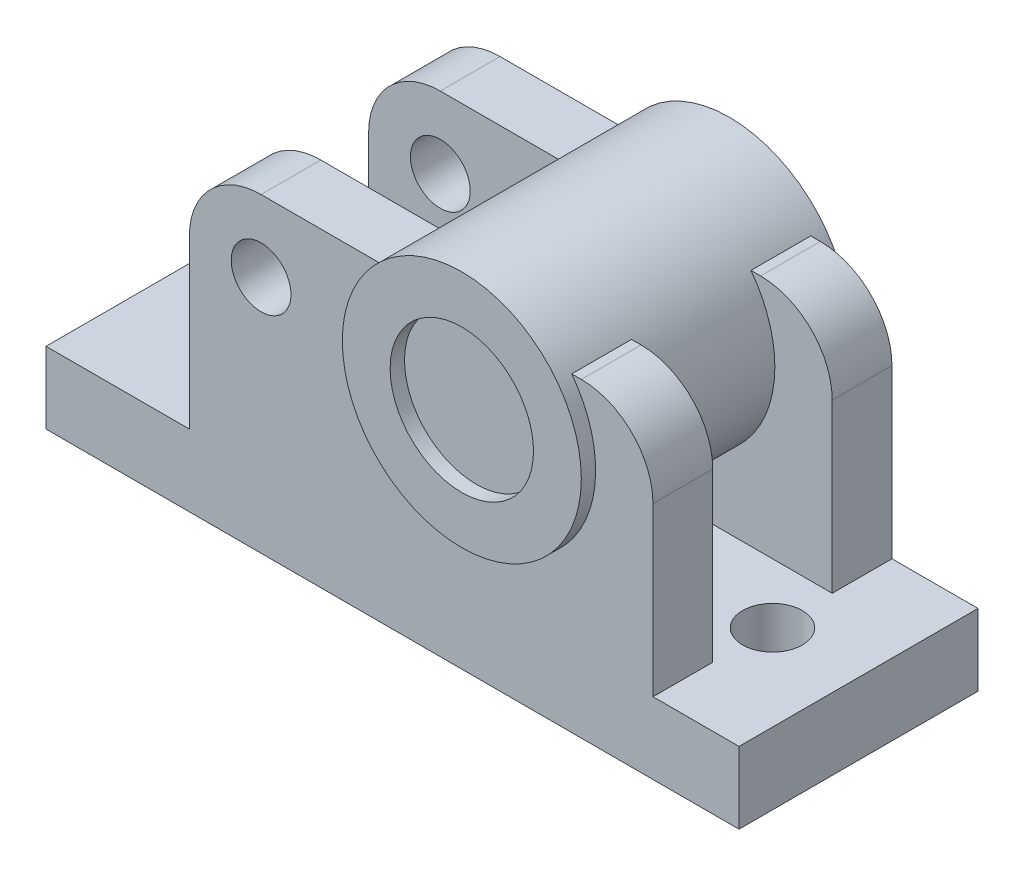
ISO-10303-21;
HEADER;
FILE_DESCRIPTION(('STEP AP214'),'2;1');
FILE_NAME('part.step','',(''),(''),'','','');
FILE_SCHEMA(('AUTOMOTIVE_DESIGN { 1 0 10303 214 1 1 1 1 }'));
ENDSEC;
DATA;
#1=APPLICATION_CONTEXT('core data for automotive mechanical design processes');
#2=APPLICATION_PROTOCOL_DEFINITION('international standard','automotive_design',2000,#1);
#3=PRODUCT_CONTEXT('',#1,'mechanical');
#4=PRODUCT('Part','Part','',(#3));
#5=PRODUCT_RELATED_PRODUCT_CATEGORY('part','',(#4));
#6=PRODUCT_DEFINITION_FORMATION('','',#4);
#7=PRODUCT_DEFINITION_CONTEXT('part definition',#1,'design');
#8=PRODUCT_DEFINITION('design','',#6,#7);
#9=PRODUCT_DEFINITION_SHAPE('','',#8);
#10=(LENGTH_UNIT() NAMED_UNIT(*) SI_UNIT(.MILLI.,.METRE.));
#11=(NAMED_UNIT(*) PLANE_ANGLE_UNIT() SI_UNIT($,.RADIAN.));
#12=(NAMED_UNIT(*) SI_UNIT($,.STERADIAN.) SOLID_ANGLE_UNIT());
#13=UNCERTAINTY_MEASURE_WITH_UNIT(LENGTH_MEASURE(1.E-05),#10,'distance_accuracy_value','');
#14=(GEOMETRIC_REPRESENTATION_CONTEXT(3) GLOBAL_UNCERTAINTY_ASSIGNED_CONTEXT((#13)) GLOBAL_UNIT_ASSIGNED_CONTEXT((#10,
#11,#12)) REPRESENTATION_CONTEXT('',''));
#15=CARTESIAN_POINT('',(0.,0.,0.));
#16=DIRECTION('',(0.,0.,1.));
#17=DIRECTION('',(1.,0.,0.));
#18=AXIS2_PLACEMENT_3D('',#15,#16,#17);
#19=CARTESIAN_POINT('',(60.,130.,25.));
#20=DIRECTION('',(0.,1.,0.));
#21=DIRECTION('',(0.,0.,1.));
#22=AXIS2_PLACEMENT_3D('',#19,#20,#21);
#23=PLANE('',#22);
#24=DIRECTION('',(-1.,0.,0.));
#25=VECTOR('',#24,1.);
#26=CARTESIAN_POINT('',(60.,130.,25.));
#27=LINE('',#26,#25);
#28=CARTESIAN_POINT('',(224.,130.,25.));
#29=VERTEX_POINT('',#28);
#30=CARTESIAN_POINT('',(220.,130.,25.));
#31=VERTEX_POINT('',#30);
#32=EDGE_CURVE('E304',#29,#31,#27,.T.);
#33=ORIENTED_EDGE('',*,*,#32,.T.);
#34=DIRECTION('',(0.,0.,-1.));
#35=VECTOR('',#34,1.);
#36=CARTESIAN_POINT('',(220.,130.,56.));
#37=LINE('',#36,#35);
#38=CARTESIAN_POINT('',(220.,130.,50.));
#39=VERTEX_POINT('',#38);
#40=EDGE_CURVE('E52',#31,#39,#37,.F.);
#41=ORIENTED_EDGE('',*,*,#40,.T.);
#42=DIRECTION('',(-1.,0.,0.));
#43=VECTOR('',#42,1.);
#44=CARTESIAN_POINT('',(60.,130.,50.));
#45=LINE('',#44,#43);
#46=CARTESIAN_POINT('',(224.,130.,50.));
#47=VERTEX_POINT('',#46);
#48=EDGE_CURVE('E297',#47,#39,#45,.T.);
#49=ORIENTED_EDGE('',*,*,#48,.F.);
#50=DIRECTION('',(0.,0.,1.));
#51=VECTOR('',#50,1.);
#52=CARTESIAN_POINT('',(224.,130.,25.));
#53=LINE('',#52,#51);
#54=EDGE_CURVE('E339',#47,#29,#53,.F.);
#55=ORIENTED_EDGE('',*,*,#54,.T.);
#56=EDGE_LOOP('',(#33,#41,#49,#55));
#57=FACE_BOUND('',#56,.T.);
#58=ADVANCED_FACE('F34',(#57),#23,.T.);
#59=CARTESIAN_POINT('',(140.,130.,50.));
#60=VERTEX_POINT('',#59);
#61=CARTESIAN_POINT('',(90.,130.,50.));
#62=VERTEX_POINT('',#61);
#63=EDGE_CURVE('E310',#60,#62,#45,.T.);
#64=ORIENTED_EDGE('',*,*,#63,.F.);
#65=DIRECTION('',(0.,0.,-1.));
#66=VECTOR('',#65,1.);
#67=CARTESIAN_POINT('',(140.,130.,56.));
#68=LINE('',#67,#66);
#69=CARTESIAN_POINT('',(140.,130.,25.));
#70=VERTEX_POINT('',#69);
#71=EDGE_CURVE('E236',#60,#70,#68,.T.);
#72=ORIENTED_EDGE('',*,*,#71,.T.);
#73=CARTESIAN_POINT('',(90.,130.,25.));
#74=VERTEX_POINT('',#73);
#75=EDGE_CURVE('E303',#70,#74,#27,.T.);
#76=ORIENTED_EDGE('',*,*,#75,.T.);
#77=DIRECTION('',(0.,0.,1.));
#78=VECTOR('',#77,1.);
#79=CARTESIAN_POINT('',(90.,130.,25.));
#80=LINE('',#79,#78);
#81=EDGE_CURVE('E336',#74,#62,#80,.T.);
#82=ORIENTED_EDGE('',*,*,#81,.T.);
#83=EDGE_LOOP('',(#64,#72,#76,#82));
#84=FACE_BOUND('',#83,.T.);
#85=ADVANCED_FACE('F351',(#84),#23,.T.);
#86=CARTESIAN_POINT('',(90.,130.,-25.));
#87=DIRECTION('',(0.,1.,0.));
#88=DIRECTION('',(0.,0.,1.));
#89=AXIS2_PLACEMENT_3D('',#86,#87,#88);
#90=PLANE('',#89);
#91=DIRECTION('',(1.,0.,0.));
#92=VECTOR('',#91,1.);
#93=CARTESIAN_POINT('',(90.,130.,-50.));
#94=LINE('',#93,#92);
#95=CARTESIAN_POINT('',(220.,130.,-50.));
#96=VERTEX_POINT('',#95);
#97=CARTESIAN_POINT('',(224.,130.,-50.));
#98=VERTEX_POINT('',#97);
#99=EDGE_CURVE('E193',#96,#98,#94,.T.);
#100=ORIENTED_EDGE('',*,*,#99,.F.);
#101=DIRECTION('',(0.,0.,-1.));
#102=VECTOR('',#101,1.);
#103=CARTESIAN_POINT('',(220.,130.,56.));
#104=LINE('',#103,#102);
#105=CARTESIAN_POINT('',(220.,130.,-25.));
#106=VERTEX_POINT('',#105);
#107=EDGE_CURVE('E191',#96,#106,#104,.F.);
#108=ORIENTED_EDGE('',*,*,#107,.T.);
#109=DIRECTION('',(1.,0.,0.));
#110=VECTOR('',#109,1.);
#111=CARTESIAN_POINT('',(90.,130.,-25.));
#112=LINE('',#111,#110);
#113=CARTESIAN_POINT('',(224.,130.,-25.));
#114=VERTEX_POINT('',#113);
#115=EDGE_CURVE('E174',#106,#114,#112,.T.);
#116=ORIENTED_EDGE('',*,*,#115,.T.);
#117=DIRECTION('',(0.,0.,-1.));
#118=VECTOR('',#117,1.);
#119=CARTESIAN_POINT('',(224.,130.,-25.));
#120=LINE('',#119,#118);
#121=EDGE_CURVE('E285',#114,#98,#120,.T.);
#122=ORIENTED_EDGE('',*,*,#121,.T.);
#123=EDGE_LOOP('',(#100,#108,#116,#122));
#124=FACE_BOUND('',#123,.T.);
#125=ADVANCED_FACE('F192',(#124),#90,.T.);
#126=CARTESIAN_POINT('',(90.,130.,-25.));
#127=VERTEX_POINT('',#126);
#128=CARTESIAN_POINT('',(140.,130.,-25.));
#129=VERTEX_POINT('',#128);
#130=EDGE_CURVE('E187',#127,#129,#112,.T.);
#131=ORIENTED_EDGE('',*,*,#130,.T.);
#132=DIRECTION('',(0.,0.,-1.));
#133=VECTOR('',#132,1.);
#134=CARTESIAN_POINT('',(140.,130.,56.));
#135=LINE('',#134,#133);
#136=CARTESIAN_POINT('',(140.,130.,-50.));
#137=VERTEX_POINT('',#136);
#138=EDGE_CURVE('E195',#129,#137,#135,.T.);
#139=ORIENTED_EDGE('',*,*,#138,.T.);
#140=CARTESIAN_POINT('',(90.,130.,-50.));
#141=VERTEX_POINT('',#140);
#142=EDGE_CURVE('E264',#141,#137,#94,.T.);
#143=ORIENTED_EDGE('',*,*,#142,.F.);
#144=DIRECTION('',(0.,0.,-1.));
#145=VECTOR('',#144,1.);
#146=CARTESIAN_POINT('',(90.,130.,-25.));
#147=LINE('',#146,#145);
#148=EDGE_CURVE('E261',#127,#141,#147,.T.);
#149=ORIENTED_EDGE('',*,*,#148,.F.);
#150=EDGE_LOOP('',(#131,#139,#143,#149));
#151=FACE_BOUND('',#150,.T.);
#152=ADVANCED_FACE('F445',(#151),#90,.T.);
#153=CARTESIAN_POINT('',(0.,30.,50.));
#154=DIRECTION('',(0.,-1.,0.));
#155=DIRECTION('',(0.,0.,-1.));
#156=AXIS2_PLACEMENT_3D('',#153,#154,#155);
#157=PLANE('',#156);
#158=CARTESIAN_POINT('',(36.,30.,0.));
#159=DIRECTION('',(0.,-1.,0.));
#160=DIRECTION('',(0.,0.,-1.));
#161=AXIS2_PLACEMENT_3D('',#158,#159,#160);
#162=CIRCLE('',#161,12.5);
#163=CARTESIAN_POINT('',(36.,30.,-12.5));
#164=VERTEX_POINT('',#163);
#165=EDGE_CURVE('E775',#164,#164,#162,.T.);
#166=ORIENTED_EDGE('',*,*,#165,.T.);
#167=EDGE_LOOP('',(#166));
#168=FACE_BOUND('',#167,.T.);
#169=CARTESIAN_POINT('',(254.,30.,0.));
#170=DIRECTION('',(0.,-1.,0.));
#171=DIRECTION('',(0.,0.,-1.));
#172=AXIS2_PLACEMENT_3D('',#169,#170,#171);
#173=CIRCLE('',#172,12.5);
#174=CARTESIAN_POINT('',(254.,30.,-12.5));
#175=VERTEX_POINT('',#174);
#176=EDGE_CURVE('E313',#175,#175,#173,.F.);
#177=ORIENTED_EDGE('',*,*,#176,.F.);
#178=EDGE_LOOP('',(#177));
#179=FACE_BOUND('',#178,.T.);
#180=DIRECTION('',(-1.,0.,0.));
#181=VECTOR('',#180,1.);
#182=CARTESIAN_POINT('',(254.,30.,-25.));
#183=LINE('',#182,#181);
#184=CARTESIAN_POINT('',(254.,30.,-25.));
#185=VERTEX_POINT('',#184);
#186=CARTESIAN_POINT('',(60.,30.,-25.));
#187=VERTEX_POINT('',#186);
#188=EDGE_CURVE('E256',#185,#187,#183,.T.);
#189=ORIENTED_EDGE('',*,*,#188,.T.);
#190=DIRECTION('',(0.,0.,-1.));
#191=VECTOR('',#190,1.);
#192=CARTESIAN_POINT('',(60.,30.,-25.));
#193=LINE('',#192,#191);
#194=CARTESIAN_POINT('',(60.,30.,-50.));
#195=VERTEX_POINT('',#194);
#196=EDGE_CURVE('E277',#187,#195,#193,.T.);
#197=ORIENTED_EDGE('',*,*,#196,.T.);
#198=DIRECTION('',(-1.,0.,0.));
#199=VECTOR('',#198,1.);
#200=CARTESIAN_POINT('',(0.,30.,-50.));
#201=LINE('',#200,#199);
#202=CARTESIAN_POINT('',(0.,30.,-50.));
#203=VERTEX_POINT('',#202);
#204=EDGE_CURVE('E403',#195,#203,#201,.T.);
#205=ORIENTED_EDGE('',*,*,#204,.T.);
#206=DIRECTION('',(0.,0.,-1.));
#207=VECTOR('',#206,1.);
#208=CARTESIAN_POINT('',(0.,30.,50.));
#209=LINE('',#208,#207);
#210=CARTESIAN_POINT('',(0.,30.,50.));
#211=VERTEX_POINT('',#210);
#212=EDGE_CURVE('E379',#211,#203,#209,.T.);
#213=ORIENTED_EDGE('',*,*,#212,.F.);
#214=DIRECTION('',(-1.,0.,0.));
#215=VECTOR('',#214,1.);
#216=CARTESIAN_POINT('',(0.,30.,50.));
#217=LINE('',#216,#215);
#218=CARTESIAN_POINT('',(60.,30.,50.));
#219=VERTEX_POINT('',#218);
#220=EDGE_CURVE('E380',#219,#211,#217,.T.);
#221=ORIENTED_EDGE('',*,*,#220,.F.);
#222=DIRECTION('',(0.,0.,1.));
#223=VECTOR('',#222,1.);
#224=CARTESIAN_POINT('',(60.,30.,25.));
#225=LINE('',#224,#223);
#226=CARTESIAN_POINT('',(60.,30.,25.));
#227=VERTEX_POINT('',#226);
#228=EDGE_CURVE('E307',#227,#219,#225,.T.);
#229=ORIENTED_EDGE('',*,*,#228,.F.);
#230=DIRECTION('',(1.,0.,0.));
#231=VECTOR('',#230,1.);
#232=CARTESIAN_POINT('',(254.,30.,25.));
#233=LINE('',#232,#231);
#234=CARTESIAN_POINT('',(254.,30.,25.));
#235=VERTEX_POINT('',#234);
#236=EDGE_CURVE('E296',#227,#235,#233,.T.);
#237=ORIENTED_EDGE('',*,*,#236,.T.);
#238=DIRECTION('',(0.,0.,1.));
#239=VECTOR('',#238,1.);
#240=CARTESIAN_POINT('',(254.,30.,25.));
#241=LINE('',#240,#239);
#242=CARTESIAN_POINT('',(254.,30.,50.));
#243=VERTEX_POINT('',#242);
#244=EDGE_CURVE('E316',#235,#243,#241,.T.);
#245=ORIENTED_EDGE('',*,*,#244,.T.);
#246=CARTESIAN_POINT('',(290.,30.,50.));
#247=VERTEX_POINT('',#246);
#248=EDGE_CURVE('E374',#247,#243,#217,.T.);
#249=ORIENTED_EDGE('',*,*,#248,.F.);
#250=DIRECTION('',(0.,0.,-1.));
#251=VECTOR('',#250,1.);
#252=CARTESIAN_POINT('',(290.,30.,50.));
#253=LINE('',#252,#251);
#254=CARTESIAN_POINT('',(290.,30.,-50.));
#255=VERTEX_POINT('',#254);
#256=EDGE_CURVE('E383',#247,#255,#253,.T.);
#257=ORIENTED_EDGE('',*,*,#256,.T.);
#258=CARTESIAN_POINT('',(254.,30.,-50.));
#259=VERTEX_POINT('',#258);
#260=EDGE_CURVE('E404',#255,#259,#201,.T.);
#261=ORIENTED_EDGE('',*,*,#260,.T.);
#262=DIRECTION('',(0.,0.,-1.));
#263=VECTOR('',#262,1.);
#264=CARTESIAN_POINT('',(254.,30.,-25.));
#265=LINE('',#264,#263);
#266=EDGE_CURVE('E280',#185,#259,#265,.T.);
#267=ORIENTED_EDGE('',*,*,#266,.F.);
#268=EDGE_LOOP('',(#189,#197,#205,#213,#221,#229,#237,#245,#249,#257,#261,#267));
#269=FACE_BOUND('',#268,.T.);
#270=ADVANCED_FACE('F372',(#168,#179,#269),#157,.F.);
#271=CARTESIAN_POINT('',(0.,0.,50.));
#272=DIRECTION('',(1.,0.,0.));
#273=DIRECTION('',(0.,0.,-1.));
#274=AXIS2_PLACEMENT_3D('',#271,#272,#273);
#275=PLANE('',#274);
#276=DIRECTION('',(0.,-1.,0.));
#277=VECTOR('',#276,1.);
#278=CARTESIAN_POINT('',(0.,0.,-50.));
#279=LINE('',#278,#277);
#280=CARTESIAN_POINT('',(0.,0.,-50.));
#281=VERTEX_POINT('',#280);
#282=EDGE_CURVE('E394',#203,#281,#279,.T.);
#283=ORIENTED_EDGE('',*,*,#282,.T.);
#284=DIRECTION('',(0.,0.,-1.));
#285=VECTOR('',#284,1.);
#286=CARTESIAN_POINT('',(0.,0.,50.));
#287=LINE('',#286,#285);
#288=CARTESIAN_POINT('',(0.,0.,50.));
#289=VERTEX_POINT('',#288);
#290=EDGE_CURVE('E388',#289,#281,#287,.T.);
#291=ORIENTED_EDGE('',*,*,#290,.F.);
#292=DIRECTION('',(0.,-1.,0.));
#293=VECTOR('',#292,1.);
#294=CARTESIAN_POINT('',(0.,0.,50.));
#295=LINE('',#294,#293);
#296=EDGE_CURVE('E405',#211,#289,#295,.T.);
#297=ORIENTED_EDGE('',*,*,#296,.F.);
#298=ORIENTED_EDGE('',*,*,#212,.T.);
#299=EDGE_LOOP('',(#283,#291,#297,#298));
#300=FACE_BOUND('',#299,.T.);
#301=ADVANCED_FACE('F421',(#300),#275,.F.);
#302=CARTESIAN_POINT('',(0.,0.,50.));
#303=DIRECTION('',(0.,1.,0.));
#304=DIRECTION('',(0.,0.,1.));
#305=AXIS2_PLACEMENT_3D('',#302,#303,#304);
#306=PLANE('',#305);
#307=CARTESIAN_POINT('',(254.,0.,0.));
#308=DIRECTION('',(0.,-1.,0.));
#309=DIRECTION('',(0.,0.,-1.));
#310=AXIS2_PLACEMENT_3D('',#307,#308,#309);
#311=CIRCLE('',#310,12.5);
#312=CARTESIAN_POINT('',(254.,0.,-12.5));
#313=VERTEX_POINT('',#312);
#314=EDGE_CURVE('E772',#313,#313,#311,.T.);
#315=ORIENTED_EDGE('',*,*,#314,.F.);
#316=EDGE_LOOP('',(#315));
#317=FACE_BOUND('',#316,.T.);
#318=CARTESIAN_POINT('',(36.,0.,0.));
#319=DIRECTION('',(0.,1.,0.));
#320=DIRECTION('',(0.,0.,1.));
#321=AXIS2_PLACEMENT_3D('',#318,#319,#320);
#322=CIRCLE('',#321,12.5);
#323=CARTESIAN_POINT('',(36.,0.,12.5));
#324=VERTEX_POINT('',#323);
#325=EDGE_CURVE('E399',#324,#324,#322,.T.);
#326=ORIENTED_EDGE('',*,*,#325,.T.);
#327=EDGE_LOOP('',(#326));
#328=FACE_BOUND('',#327,.T.);
#329=DIRECTION('',(1.,0.,0.));
#330=VECTOR('',#329,1.);
#331=CARTESIAN_POINT('',(0.,0.,-50.));
#332=LINE('',#331,#330);
#333=CARTESIAN_POINT('',(290.,0.,-50.));
#334=VERTEX_POINT('',#333);
#335=EDGE_CURVE('E398',#281,#334,#332,.T.);
#336=ORIENTED_EDGE('',*,*,#335,.T.);
#337=DIRECTION('',(0.,0.,-1.));
#338=VECTOR('',#337,1.);
#339=CARTESIAN_POINT('',(290.,0.,50.));
#340=LINE('',#339,#338);
#341=CARTESIAN_POINT('',(290.,0.,50.));
#342=VERTEX_POINT('',#341);
#343=EDGE_CURVE('E407',#342,#334,#340,.T.);
#344=ORIENTED_EDGE('',*,*,#343,.F.);
#345=DIRECTION('',(1.,0.,0.));
#346=VECTOR('',#345,1.);
#347=CARTESIAN_POINT('',(0.,0.,50.));
#348=LINE('',#347,#346);
#349=EDGE_CURVE('E416',#289,#342,#348,.T.);
#350=ORIENTED_EDGE('',*,*,#349,.F.);
#351=ORIENTED_EDGE('',*,*,#290,.T.);
#352=EDGE_LOOP('',(#336,#344,#350,#351));
#353=FACE_BOUND('',#352,.T.);
#354=ADVANCED_FACE('F415',(#317,#328,#353),#306,.F.);
#355=CARTESIAN_POINT('',(290.,0.,50.));
#356=DIRECTION('',(-1.,0.,0.));
#357=DIRECTION('',(0.,0.,1.));
#358=AXIS2_PLACEMENT_3D('',#355,#356,#357);
#359=PLANE('',#358);
#360=DIRECTION('',(0.,1.,0.));
#361=VECTOR('',#360,1.);
#362=CARTESIAN_POINT('',(290.,0.,-50.));
#363=LINE('',#362,#361);
#364=EDGE_CURVE('E401',#334,#255,#363,.T.);
#365=ORIENTED_EDGE('',*,*,#364,.T.);
#366=ORIENTED_EDGE('',*,*,#256,.F.);
#367=DIRECTION('',(0.,1.,0.));
#368=VECTOR('',#367,1.);
#369=CARTESIAN_POINT('',(290.,0.,50.));
#370=LINE('',#369,#368);
#371=EDGE_CURVE('E377',#342,#247,#370,.T.);
#372=ORIENTED_EDGE('',*,*,#371,.F.);
#373=ORIENTED_EDGE('',*,*,#343,.T.);
#374=EDGE_LOOP('',(#365,#366,#372,#373));
#375=FACE_BOUND('',#374,.T.);
#376=ADVANCED_FACE('F426',(#375),#359,.F.);
#377=CARTESIAN_POINT('',(0.,0.,50.));
#378=DIRECTION('',(0.,0.,-1.));
#379=DIRECTION('',(-1.,0.,0.));
#380=AXIS2_PLACEMENT_3D('',#377,#378,#379);
#381=PLANE('',#380);
#382=CARTESIAN_POINT('',(180.,100.,50.));
#383=DIRECTION('',(0.,0.,-1.));
#384=DIRECTION('',(-1.,0.,0.));
#385=AXIS2_PLACEMENT_3D('',#382,#383,#384);
#386=CIRCLE('',#385,50.);
#387=EDGE_CURVE('E240',#60,#39,#386,.F.);
#388=ORIENTED_EDGE('',*,*,#387,.F.);
#389=ORIENTED_EDGE('',*,*,#63,.T.);
#390=CARTESIAN_POINT('',(90.,100.,50.));
#391=DIRECTION('',(0.,0.,-1.));
#392=DIRECTION('',(-1.,0.,0.));
#393=AXIS2_PLACEMENT_3D('',#390,#391,#392);
#394=CIRCLE('',#393,30.);
#395=CARTESIAN_POINT('',(60.,100.,50.));
#396=VERTEX_POINT('',#395);
#397=EDGE_CURVE('E332',#62,#396,#394,.F.);
#398=ORIENTED_EDGE('',*,*,#397,.T.);
#399=DIRECTION('',(0.,-1.,0.));
#400=VECTOR('',#399,1.);
#401=CARTESIAN_POINT('',(60.,30.,50.));
#402=LINE('',#401,#400);
#403=EDGE_CURVE('E291',#396,#219,#402,.T.);
#404=ORIENTED_EDGE('',*,*,#403,.T.);
#405=ORIENTED_EDGE('',*,*,#220,.T.);
#406=ORIENTED_EDGE('',*,*,#296,.T.);
#407=ORIENTED_EDGE('',*,*,#349,.T.);
#408=ORIENTED_EDGE('',*,*,#371,.T.);
#409=ORIENTED_EDGE('',*,*,#248,.T.);
#410=DIRECTION('',(0.,1.,0.));
#411=VECTOR('',#410,1.);
#412=CARTESIAN_POINT('',(254.,130.,50.));
#413=LINE('',#412,#411);
#414=CARTESIAN_POINT('',(254.,100.,50.));
#415=VERTEX_POINT('',#414);
#416=EDGE_CURVE('E331',#243,#415,#413,.T.);
#417=ORIENTED_EDGE('',*,*,#416,.T.);
#418=CARTESIAN_POINT('',(224.,100.,50.));
#419=DIRECTION('',(0.,0.,-1.));
#420=DIRECTION('',(-1.,0.,0.));
#421=AXIS2_PLACEMENT_3D('',#418,#419,#420);
#422=CIRCLE('',#421,30.);
#423=EDGE_CURVE('E334',#415,#47,#422,.F.);
#424=ORIENTED_EDGE('',*,*,#423,.T.);
#425=ORIENTED_EDGE('',*,*,#48,.T.);
#426=EDGE_LOOP('',(#388,#389,#398,#404,#405,#406,#407,#408,#409,#417,#424,#425));
#427=FACE_BOUND('',#426,.T.);
#428=CARTESIAN_POINT('',(90.,100.,50.));
#429=DIRECTION('',(0.,0.,1.));
#430=DIRECTION('',(1.,0.,0.));
#431=AXIS2_PLACEMENT_3D('',#428,#429,#430);
#432=CIRCLE('',#431,12.5);
#433=CARTESIAN_POINT('',(102.5,100.,50.));
#434=VERTEX_POINT('',#433);
#435=EDGE_CURVE('E276',#434,#434,#432,.T.);
#436=ORIENTED_EDGE('',*,*,#435,.F.);
#437=EDGE_LOOP('',(#436));
#438=FACE_BOUND('',#437,.T.);
#439=ADVANCED_FACE('F354',(#427,#438),#381,.F.);
#440=CARTESIAN_POINT('',(0.,0.,-50.));
#441=DIRECTION('',(0.,0.,-1.));
#442=DIRECTION('',(-1.,0.,0.));
#443=AXIS2_PLACEMENT_3D('',#440,#441,#442);
#444=PLANE('',#443);
#445=ORIENTED_EDGE('',*,*,#142,.T.);
#446=CARTESIAN_POINT('',(180.,100.,-50.));
#447=DIRECTION('',(0.,0.,-1.));
#448=DIRECTION('',(-1.,0.,0.));
#449=AXIS2_PLACEMENT_3D('',#446,#447,#448);
#450=CIRCLE('',#449,50.);
#451=EDGE_CURVE('E60',#137,#96,#450,.F.);
#452=ORIENTED_EDGE('',*,*,#451,.T.);
#453=ORIENTED_EDGE('',*,*,#99,.T.);
#454=CARTESIAN_POINT('',(224.,100.,-50.));
#455=DIRECTION('',(0.,0.,-1.));
#456=DIRECTION('',(-1.,0.,0.));
#457=AXIS2_PLACEMENT_3D('',#454,#455,#456);
#458=CIRCLE('',#457,30.);
#459=CARTESIAN_POINT('',(254.,100.,-50.));
#460=VERTEX_POINT('',#459);
#461=EDGE_CURVE('E266',#98,#460,#458,.T.);
#462=ORIENTED_EDGE('',*,*,#461,.T.);
#463=DIRECTION('',(0.,-1.,0.));
#464=VECTOR('',#463,1.);
#465=CARTESIAN_POINT('',(254.,100.,-50.));
#466=LINE('',#465,#464);
#467=EDGE_CURVE('E269',#460,#259,#466,.T.);
#468=ORIENTED_EDGE('',*,*,#467,.T.);
#469=ORIENTED_EDGE('',*,*,#260,.F.);
#470=ORIENTED_EDGE('',*,*,#364,.F.);
#471=ORIENTED_EDGE('',*,*,#335,.F.);
#472=ORIENTED_EDGE('',*,*,#282,.F.);
#473=ORIENTED_EDGE('',*,*,#204,.F.);
#474=DIRECTION('',(0.,1.,0.));
#475=VECTOR('',#474,1.);
#476=CARTESIAN_POINT('',(60.,30.,-50.));
#477=LINE('',#476,#475);
#478=CARTESIAN_POINT('',(60.,100.,-50.));
#479=VERTEX_POINT('',#478);
#480=EDGE_CURVE('E250',#195,#479,#477,.T.);
#481=ORIENTED_EDGE('',*,*,#480,.T.);
#482=CARTESIAN_POINT('',(90.,100.,-50.));
#483=DIRECTION('',(0.,0.,-1.));
#484=DIRECTION('',(-1.,0.,0.));
#485=AXIS2_PLACEMENT_3D('',#482,#483,#484);
#486=CIRCLE('',#485,30.);
#487=EDGE_CURVE('E246',#479,#141,#486,.T.);
#488=ORIENTED_EDGE('',*,*,#487,.T.);
#489=EDGE_LOOP('',(#445,#452,#453,#462,#468,#469,#470,#471,#472,#473,#481,#488));
#490=FACE_BOUND('',#489,.T.);
#491=CARTESIAN_POINT('',(90.,100.,-50.));
#492=DIRECTION('',(0.,0.,-1.));
#493=DIRECTION('',(-1.,0.,0.));
#494=AXIS2_PLACEMENT_3D('',#491,#492,#493);
#495=CIRCLE('',#494,12.5);
#496=CARTESIAN_POINT('',(77.5,100.,-50.));
#497=VERTEX_POINT('',#496);
#498=EDGE_CURVE('E242',#497,#497,#495,.T.);
#499=ORIENTED_EDGE('',*,*,#498,.F.);
#500=EDGE_LOOP('',(#499));
#501=FACE_BOUND('',#500,.T.);
#502=ADVANCED_FACE('F423',(#490,#501),#444,.T.);
#503=CARTESIAN_POINT('',(36.,30.001,0.));
#504=DIRECTION('',(0.,-1.,0.));
#505=DIRECTION('',(0.,0.,-1.));
#506=AXIS2_PLACEMENT_3D('',#503,#504,#505);
#507=CYLINDRICAL_SURFACE('',#506,12.5);
#508=ORIENTED_EDGE('',*,*,#325,.F.);
#509=EDGE_LOOP('',(#508));
#510=FACE_BOUND('',#509,.T.);
#511=ORIENTED_EDGE('',*,*,#165,.F.);
#512=EDGE_LOOP('',(#511));
#513=FACE_BOUND('',#512,.T.);
#514=ADVANCED_FACE('F472',(#510,#513),#507,.F.);
#515=CARTESIAN_POINT('',(254.,30.001,0.));
#516=DIRECTION('',(0.,-1.,0.));
#517=DIRECTION('',(0.,0.,-1.));
#518=AXIS2_PLACEMENT_3D('',#515,#516,#517);
#519=CYLINDRICAL_SURFACE('',#518,12.5);
#520=ORIENTED_EDGE('',*,*,#314,.T.);
#521=EDGE_LOOP('',(#520));
#522=FACE_BOUND('',#521,.T.);
#523=ORIENTED_EDGE('',*,*,#176,.T.);
#524=EDGE_LOOP('',(#523));
#525=FACE_BOUND('',#524,.T.);
#526=ADVANCED_FACE('F469',(#522,#525),#519,.F.);
#527=CARTESIAN_POINT('',(60.,30.,25.));
#528=DIRECTION('',(-1.,0.,0.));
#529=DIRECTION('',(0.,0.,1.));
#530=AXIS2_PLACEMENT_3D('',#527,#528,#529);
#531=PLANE('',#530);
#532=ORIENTED_EDGE('',*,*,#403,.F.);
#533=DIRECTION('',(0.,0.,1.));
#534=VECTOR('',#533,1.);
#535=CARTESIAN_POINT('',(60.,100.,25.));
#536=LINE('',#535,#534);
#537=CARTESIAN_POINT('',(60.,100.,25.));
#538=VERTEX_POINT('',#537);
#539=EDGE_CURVE('E200',#396,#538,#536,.F.);
#540=ORIENTED_EDGE('',*,*,#539,.T.);
#541=DIRECTION('',(0.,-1.,0.));
#542=VECTOR('',#541,1.);
#543=CARTESIAN_POINT('',(60.,30.,25.));
#544=LINE('',#543,#542);
#545=EDGE_CURVE('E294',#538,#227,#544,.T.);
#546=ORIENTED_EDGE('',*,*,#545,.T.);
#547=ORIENTED_EDGE('',*,*,#228,.T.);
#548=EDGE_LOOP('',(#532,#540,#546,#547));
#549=FACE_BOUND('',#548,.T.);
#550=ADVANCED_FACE('F466',(#549),#531,.T.);
#551=CARTESIAN_POINT('',(254.,130.,25.));
#552=DIRECTION('',(1.,0.,0.));
#553=DIRECTION('',(0.,0.,-1.));
#554=AXIS2_PLACEMENT_3D('',#551,#552,#553);
#555=PLANE('',#554);
#556=DIRECTION('',(0.,1.,0.));
#557=VECTOR('',#556,1.);
#558=CARTESIAN_POINT('',(254.,130.,25.));
#559=LINE('',#558,#557);
#560=CARTESIAN_POINT('',(254.,100.,25.));
#561=VERTEX_POINT('',#560);
#562=EDGE_CURVE('E300',#235,#561,#559,.T.);
#563=ORIENTED_EDGE('',*,*,#562,.T.);
#564=DIRECTION('',(0.,0.,1.));
#565=VECTOR('',#564,1.);
#566=CARTESIAN_POINT('',(254.,100.,25.));
#567=LINE('',#566,#565);
#568=EDGE_CURVE('E328',#561,#415,#567,.T.);
#569=ORIENTED_EDGE('',*,*,#568,.T.);
#570=ORIENTED_EDGE('',*,*,#416,.F.);
#571=ORIENTED_EDGE('',*,*,#244,.F.);
#572=EDGE_LOOP('',(#563,#569,#570,#571));
#573=FACE_BOUND('',#572,.T.);
#574=ADVANCED_FACE('F368',(#573),#555,.T.);
#575=CARTESIAN_POINT('',(0.,0.,25.));
#576=DIRECTION('',(0.,0.,-1.));
#577=DIRECTION('',(-1.,0.,0.));
#578=AXIS2_PLACEMENT_3D('',#575,#576,#577);
#579=PLANE('',#578);
#580=CARTESIAN_POINT('',(90.,100.,25.));
#581=DIRECTION('',(0.,0.,1.));
#582=DIRECTION('',(1.,0.,0.));
#583=AXIS2_PLACEMENT_3D('',#580,#581,#582);
#584=CIRCLE('',#583,12.5);
#585=CARTESIAN_POINT('',(102.5,100.,25.));
#586=VERTEX_POINT('',#585);
#587=EDGE_CURVE('E288',#586,#586,#584,.T.);
#588=ORIENTED_EDGE('',*,*,#587,.T.);
#589=EDGE_LOOP('',(#588));
#590=FACE_BOUND('',#589,.T.);
#591=ORIENTED_EDGE('',*,*,#75,.F.);
#592=CARTESIAN_POINT('',(180.,100.,25.));
#593=DIRECTION('',(0.,0.,-1.));
#594=DIRECTION('',(-1.,0.,0.));
#595=AXIS2_PLACEMENT_3D('',#592,#593,#594);
#596=CIRCLE('',#595,50.);
#597=EDGE_CURVE('E234',#70,#31,#596,.F.);
#598=ORIENTED_EDGE('',*,*,#597,.T.);
#599=ORIENTED_EDGE('',*,*,#32,.F.);
#600=CARTESIAN_POINT('',(224.,100.,25.));
#601=DIRECTION('',(0.,0.,-1.));
#602=DIRECTION('',(-1.,0.,0.));
#603=AXIS2_PLACEMENT_3D('',#600,#601,#602);
#604=CIRCLE('',#603,30.);
#605=EDGE_CURVE('E203',#29,#561,#604,.T.);
#606=ORIENTED_EDGE('',*,*,#605,.T.);
#607=ORIENTED_EDGE('',*,*,#562,.F.);
#608=ORIENTED_EDGE('',*,*,#236,.F.);
#609=ORIENTED_EDGE('',*,*,#545,.F.);
#610=CARTESIAN_POINT('',(90.,100.,25.));
#611=DIRECTION('',(0.,0.,-1.));
#612=DIRECTION('',(-1.,0.,0.));
#613=AXIS2_PLACEMENT_3D('',#610,#611,#612);
#614=CIRCLE('',#613,30.);
#615=EDGE_CURVE('E209',#538,#74,#614,.T.);
#616=ORIENTED_EDGE('',*,*,#615,.T.);
#617=EDGE_LOOP('',(#591,#598,#599,#606,#607,#608,#609,#616));
#618=FACE_BOUND('',#617,.T.);
#619=ADVANCED_FACE('F345',(#590,#618),#579,.T.);
#620=CARTESIAN_POINT('',(90.,100.,25.));
#621=DIRECTION('',(0.,0.,1.));
#622=DIRECTION('',(1.,0.,0.));
#623=AXIS2_PLACEMENT_3D('',#620,#621,#622);
#624=CYLINDRICAL_SURFACE('',#623,12.5);
#625=ORIENTED_EDGE('',*,*,#587,.F.);
#626=EDGE_LOOP('',(#625));
#627=FACE_BOUND('',#626,.T.);
#628=ORIENTED_EDGE('',*,*,#435,.T.);
#629=EDGE_LOOP('',(#628));
#630=FACE_BOUND('',#629,.T.);
#631=ADVANCED_FACE('F490',(#627,#630),#624,.F.);
#632=CARTESIAN_POINT('',(224.,100.,25.));
#633=DIRECTION('',(0.,0.,1.));
#634=DIRECTION('',(1.,0.,0.));
#635=AXIS2_PLACEMENT_3D('',#632,#633,#634);
#636=CYLINDRICAL_SURFACE('',#635,30.);
#637=ORIENTED_EDGE('',*,*,#605,.F.);
#638=ORIENTED_EDGE('',*,*,#54,.F.);
#639=ORIENTED_EDGE('',*,*,#423,.F.);
#640=ORIENTED_EDGE('',*,*,#568,.F.);
#641=EDGE_LOOP('',(#637,#638,#639,#640));
#642=FACE_BOUND('',#641,.T.);
#643=ADVANCED_FACE('F363',(#642),#636,.T.);
#644=CARTESIAN_POINT('',(90.,100.,25.));
#645=DIRECTION('',(0.,0.,1.));
#646=DIRECTION('',(1.,0.,0.));
#647=AXIS2_PLACEMENT_3D('',#644,#645,#646);
#648=CYLINDRICAL_SURFACE('',#647,30.);
#649=ORIENTED_EDGE('',*,*,#615,.F.);
#650=ORIENTED_EDGE('',*,*,#539,.F.);
#651=ORIENTED_EDGE('',*,*,#397,.F.);
#652=ORIENTED_EDGE('',*,*,#81,.F.);
#653=EDGE_LOOP('',(#649,#650,#651,#652));
#654=FACE_BOUND('',#653,.T.);
#655=ADVANCED_FACE('F36',(#654),#648,.T.);
#656=CARTESIAN_POINT('',(90.,100.,-25.));
#657=DIRECTION('',(0.,0.,-1.));
#658=DIRECTION('',(-1.,0.,0.));
#659=AXIS2_PLACEMENT_3D('',#656,#657,#658);
#660=CYLINDRICAL_SURFACE('',#659,30.);
#661=ORIENTED_EDGE('',*,*,#487,.F.);
#662=DIRECTION('',(0.,0.,-1.));
#663=VECTOR('',#662,1.);
#664=CARTESIAN_POINT('',(60.,100.,-25.));
#665=LINE('',#664,#663);
#666=CARTESIAN_POINT('',(60.,100.,-25.));
#667=VERTEX_POINT('',#666);
#668=EDGE_CURVE('E274',#667,#479,#665,.T.);
#669=ORIENTED_EDGE('',*,*,#668,.F.);
#670=CARTESIAN_POINT('',(90.,100.,-25.));
#671=DIRECTION('',(0.,0.,-1.));
#672=DIRECTION('',(-1.,0.,0.));
#673=AXIS2_PLACEMENT_3D('',#670,#671,#672);
#674=CIRCLE('',#673,30.);
#675=EDGE_CURVE('E188',#667,#127,#674,.T.);
#676=ORIENTED_EDGE('',*,*,#675,.T.);
#677=ORIENTED_EDGE('',*,*,#148,.T.);
#678=EDGE_LOOP('',(#661,#669,#676,#677));
#679=FACE_BOUND('',#678,.T.);
#680=ADVANCED_FACE('F443',(#679),#660,.T.);
#681=CARTESIAN_POINT('',(60.,30.,-25.));
#682=DIRECTION('',(-1.,0.,0.));
#683=DIRECTION('',(0.,0.,1.));
#684=AXIS2_PLACEMENT_3D('',#681,#682,#683);
#685=PLANE('',#684);
#686=ORIENTED_EDGE('',*,*,#480,.F.);
#687=ORIENTED_EDGE('',*,*,#196,.F.);
#688=DIRECTION('',(0.,1.,0.));
#689=VECTOR('',#688,1.);
#690=CARTESIAN_POINT('',(60.,30.,-25.));
#691=LINE('',#690,#689);
#692=EDGE_CURVE('E258',#187,#667,#691,.T.);
#693=ORIENTED_EDGE('',*,*,#692,.T.);
#694=ORIENTED_EDGE('',*,*,#668,.T.);
#695=EDGE_LOOP('',(#686,#687,#693,#694));
#696=FACE_BOUND('',#695,.T.);
#697=ADVANCED_FACE('F439',(#696),#685,.T.);
#698=CARTESIAN_POINT('',(254.,100.,-25.));
#699=DIRECTION('',(1.,0.,0.));
#700=DIRECTION('',(0.,0.,-1.));
#701=AXIS2_PLACEMENT_3D('',#698,#699,#700);
#702=PLANE('',#701);
#703=ORIENTED_EDGE('',*,*,#467,.F.);
#704=DIRECTION('',(0.,0.,-1.));
#705=VECTOR('',#704,1.);
#706=CARTESIAN_POINT('',(254.,100.,-25.));
#707=LINE('',#706,#705);
#708=CARTESIAN_POINT('',(254.,100.,-25.));
#709=VERTEX_POINT('',#708);
#710=EDGE_CURVE('E283',#709,#460,#707,.T.);
#711=ORIENTED_EDGE('',*,*,#710,.F.);
#712=DIRECTION('',(0.,-1.,0.));
#713=VECTOR('',#712,1.);
#714=CARTESIAN_POINT('',(254.,100.,-25.));
#715=LINE('',#714,#713);
#716=EDGE_CURVE('E253',#709,#185,#715,.T.);
#717=ORIENTED_EDGE('',*,*,#716,.T.);
#718=ORIENTED_EDGE('',*,*,#266,.T.);
#719=EDGE_LOOP('',(#703,#711,#717,#718));
#720=FACE_BOUND('',#719,.T.);
#721=ADVANCED_FACE('F430',(#720),#702,.T.);
#722=CARTESIAN_POINT('',(224.,100.,-25.));
#723=DIRECTION('',(0.,0.,-1.));
#724=DIRECTION('',(-1.,0.,0.));
#725=AXIS2_PLACEMENT_3D('',#722,#723,#724);
#726=CYLINDRICAL_SURFACE('',#725,30.);
#727=ORIENTED_EDGE('',*,*,#461,.F.);
#728=ORIENTED_EDGE('',*,*,#121,.F.);
#729=CARTESIAN_POINT('',(224.,100.,-25.));
#730=DIRECTION('',(0.,0.,-1.));
#731=DIRECTION('',(-1.,0.,0.));
#732=AXIS2_PLACEMENT_3D('',#729,#730,#731);
#733=CIRCLE('',#732,30.);
#734=EDGE_CURVE('E183',#114,#709,#733,.T.);
#735=ORIENTED_EDGE('',*,*,#734,.T.);
#736=ORIENTED_EDGE('',*,*,#710,.T.);
#737=EDGE_LOOP('',(#727,#728,#735,#736));
#738=FACE_BOUND('',#737,.T.);
#739=ADVANCED_FACE('F433',(#738),#726,.T.);
#740=CARTESIAN_POINT('',(90.,100.,-25.));
#741=DIRECTION('',(0.,0.,-1.));
#742=DIRECTION('',(-1.,0.,0.));
#743=AXIS2_PLACEMENT_3D('',#740,#741,#742);
#744=PLANE('',#743);
#745=CARTESIAN_POINT('',(180.,100.,-25.));
#746=DIRECTION('',(0.,0.,-1.));
#747=DIRECTION('',(-1.,0.,0.));
#748=AXIS2_PLACEMENT_3D('',#745,#746,#747);
#749=CIRCLE('',#748,50.);
#750=EDGE_CURVE('E38',#129,#106,#749,.F.);
#751=ORIENTED_EDGE('',*,*,#750,.F.);
#752=ORIENTED_EDGE('',*,*,#130,.F.);
#753=ORIENTED_EDGE('',*,*,#675,.F.);
#754=ORIENTED_EDGE('',*,*,#692,.F.);
#755=ORIENTED_EDGE('',*,*,#188,.F.);
#756=ORIENTED_EDGE('',*,*,#716,.F.);
#757=ORIENTED_EDGE('',*,*,#734,.F.);
#758=ORIENTED_EDGE('',*,*,#115,.F.);
#759=EDGE_LOOP('',(#751,#752,#753,#754,#755,#756,#757,#758));
#760=FACE_BOUND('',#759,.T.);
#761=CARTESIAN_POINT('',(90.,100.,-25.));
#762=DIRECTION('',(0.,0.,-1.));
#763=DIRECTION('',(-1.,0.,0.));
#764=AXIS2_PLACEMENT_3D('',#761,#762,#763);
#765=CIRCLE('',#764,12.5);
#766=CARTESIAN_POINT('',(77.5,100.,-25.));
#767=VERTEX_POINT('',#766);
#768=EDGE_CURVE('E243',#767,#767,#765,.T.);
#769=ORIENTED_EDGE('',*,*,#768,.T.);
#770=EDGE_LOOP('',(#769));
#771=FACE_BOUND('',#770,.T.);
#772=ADVANCED_FACE('F176',(#760,#771),#744,.F.);
#773=CARTESIAN_POINT('',(90.,100.,-25.));
#774=DIRECTION('',(0.,0.,-1.));
#775=DIRECTION('',(-1.,0.,0.));
#776=AXIS2_PLACEMENT_3D('',#773,#774,#775);
#777=CYLINDRICAL_SURFACE('',#776,12.5);
#778=ORIENTED_EDGE('',*,*,#768,.F.);
#779=EDGE_LOOP('',(#778));
#780=FACE_BOUND('',#779,.T.);
#781=ORIENTED_EDGE('',*,*,#498,.T.);
#782=EDGE_LOOP('',(#781));
#783=FACE_BOUND('',#782,.T.);
#784=ADVANCED_FACE('F518',(#780,#783),#777,.F.);
#785=CARTESIAN_POINT('',(180.,100.,56.));
#786=DIRECTION('',(0.,0.,-1.));
#787=DIRECTION('',(-1.,0.,0.));
#788=AXIS2_PLACEMENT_3D('',#785,#786,#787);
#789=CYLINDRICAL_SURFACE('',#788,50.);
#790=ORIENTED_EDGE('',*,*,#451,.F.);
#791=ORIENTED_EDGE('',*,*,#138,.F.);
#792=ORIENTED_EDGE('',*,*,#750,.T.);
#793=ORIENTED_EDGE('',*,*,#107,.F.);
#794=EDGE_LOOP('',(#790,#791,#792,#793));
#795=FACE_BOUND('',#794,.T.);
#796=CARTESIAN_POINT('',(180.,100.,56.));
#797=DIRECTION('',(0.,0.,1.));
#798=DIRECTION('',(1.,0.,0.));
#799=AXIS2_PLACEMENT_3D('',#796,#797,#798);
#800=CIRCLE('',#799,50.);
#801=CARTESIAN_POINT('',(230.,100.,56.));
#802=VERTEX_POINT('',#801);
#803=EDGE_CURVE('E215',#802,#802,#800,.T.);
#804=ORIENTED_EDGE('',*,*,#803,.F.);
#805=EDGE_LOOP('',(#804));
#806=FACE_BOUND('',#805,.T.);
#807=CARTESIAN_POINT('',(180.,100.,-56.));
#808=DIRECTION('',(0.,0.,1.));
#809=DIRECTION('',(1.,0.,0.));
#810=AXIS2_PLACEMENT_3D('',#807,#808,#809);
#811=CIRCLE('',#810,50.);
#812=CARTESIAN_POINT('',(230.,100.,-56.));
#813=VERTEX_POINT('',#812);
#814=EDGE_CURVE('E221',#813,#813,#811,.T.);
#815=ORIENTED_EDGE('',*,*,#814,.T.);
#816=EDGE_LOOP('',(#815));
#817=FACE_BOUND('',#816,.T.);
#818=ORIENTED_EDGE('',*,*,#71,.F.);
#819=ORIENTED_EDGE('',*,*,#387,.T.);
#820=ORIENTED_EDGE('',*,*,#40,.F.);
#821=ORIENTED_EDGE('',*,*,#597,.F.);
#822=EDGE_LOOP('',(#818,#819,#820,#821));
#823=FACE_BOUND('',#822,.T.);
#824=ADVANCED_FACE('F198',(#795,#806,#817,#823),#789,.T.);
#825=CARTESIAN_POINT('',(180.,100.,56.));
#826=DIRECTION('',(0.,0.,-1.));
#827=DIRECTION('',(-1.,0.,0.));
#828=AXIS2_PLACEMENT_3D('',#825,#826,#827);
#829=CYLINDRICAL_SURFACE('',#828,30.);
#830=CARTESIAN_POINT('',(180.,100.,56.));
#831=DIRECTION('',(0.,0.,1.));
#832=DIRECTION('',(1.,0.,0.));
#833=AXIS2_PLACEMENT_3D('',#830,#831,#832);
#834=CIRCLE('',#833,30.);
#835=CARTESIAN_POINT('',(210.,100.,56.));
#836=VERTEX_POINT('',#835);
#837=EDGE_CURVE('E226',#836,#836,#834,.T.);
#838=ORIENTED_EDGE('',*,*,#837,.T.);
#839=EDGE_LOOP('',(#838));
#840=FACE_BOUND('',#839,.T.);
#841=CARTESIAN_POINT('',(180.,100.,50.));
#842=DIRECTION('',(0.,0.,-1.));
#843=DIRECTION('',(-1.,0.,0.));
#844=AXIS2_PLACEMENT_3D('',#841,#842,#843);
#845=CIRCLE('',#844,30.);
#846=CARTESIAN_POINT('',(150.,100.,50.));
#847=VERTEX_POINT('',#846);
#848=EDGE_CURVE('E214',#847,#847,#845,.F.);
#849=ORIENTED_EDGE('',*,*,#848,.F.);
#850=EDGE_LOOP('',(#849));
#851=FACE_BOUND('',#850,.T.);
#852=ADVANCED_FACE('F534',(#840,#851),#829,.F.);
#853=CARTESIAN_POINT('',(180.,100.,56.));
#854=DIRECTION('',(0.,0.,1.));
#855=DIRECTION('',(1.,0.,0.));
#856=AXIS2_PLACEMENT_3D('',#853,#854,#855);
#857=PLANE('',#856);
#858=ORIENTED_EDGE('',*,*,#803,.T.);
#859=EDGE_LOOP('',(#858));
#860=FACE_BOUND('',#859,.T.);
#861=ORIENTED_EDGE('',*,*,#837,.F.);
#862=EDGE_LOOP('',(#861));
#863=FACE_BOUND('',#862,.T.);
#864=ADVANCED_FACE('F545',(#860,#863),#857,.T.);
#865=CARTESIAN_POINT('',(180.,100.,-56.));
#866=DIRECTION('',(0.,0.,1.));
#867=DIRECTION('',(1.,0.,0.));
#868=AXIS2_PLACEMENT_3D('',#865,#866,#867);
#869=PLANE('',#868);
#870=ORIENTED_EDGE('',*,*,#814,.F.);
#871=EDGE_LOOP('',(#870));
#872=FACE_BOUND('',#871,.T.);
#873=CARTESIAN_POINT('',(180.,100.,-56.));
#874=DIRECTION('',(0.,0.,1.));
#875=DIRECTION('',(1.,0.,0.));
#876=AXIS2_PLACEMENT_3D('',#873,#874,#875);
#877=CIRCLE('',#876,30.);
#878=CARTESIAN_POINT('',(210.,100.,-56.));
#879=VERTEX_POINT('',#878);
#880=EDGE_CURVE('E229',#879,#879,#877,.T.);
#881=ORIENTED_EDGE('',*,*,#880,.T.);
#882=EDGE_LOOP('',(#881));
#883=FACE_BOUND('',#882,.T.);
#884=ADVANCED_FACE('F542',(#872,#883),#869,.F.);
#885=CARTESIAN_POINT('',(180.,100.,-50.));
#886=DIRECTION('',(0.,0.,-1.));
#887=DIRECTION('',(-1.,0.,0.));
#888=AXIS2_PLACEMENT_3D('',#885,#886,#887);
#889=CIRCLE('',#888,30.);
#890=CARTESIAN_POINT('',(150.,100.,-50.));
#891=VERTEX_POINT('',#890);
#892=EDGE_CURVE('E11',#891,#891,#889,.F.);
#893=ORIENTED_EDGE('',*,*,#892,.T.);
#894=EDGE_LOOP('',(#893));
#895=FACE_BOUND('',#894,.T.);
#896=ORIENTED_EDGE('',*,*,#880,.F.);
#897=EDGE_LOOP('',(#896));
#898=FACE_BOUND('',#897,.T.);
#899=ADVANCED_FACE('F533',(#895,#898),#829,.F.);
#900=ORIENTED_EDGE('',*,*,#892,.F.);
#901=EDGE_LOOP('',(#900));
#902=FACE_BOUND('',#901,.T.);
#903=ADVANCED_FACE('F481',(#902),#444,.T.);
#904=ORIENTED_EDGE('',*,*,#848,.T.);
#905=EDGE_LOOP('',(#904));
#906=FACE_BOUND('',#905,.T.);
#907=ADVANCED_FACE('F479',(#906),#381,.F.);
#908=CLOSED_SHELL('',(#58,#85,#125,#152,#270,#301,#354,#376,#439,#502,#514,#526,#550,#574,#619,
#631,#643,#655,#680,#697,#721,#739,#772,#784,#824,#852,#864,#884,#899,#903,#907));
#909=CARTESIAN_POINT('',(180.,100.,-25.));
#910=DIRECTION('',(0.,0.,-1.));
#911=DIRECTION('',(-1.,0.,0.));
#912=AXIS2_PLACEMENT_3D('',#909,#910,#911);
#913=CIRCLE('',#912,30.);
#914=CARTESIAN_POINT('',(150.,100.,-25.));
#915=VERTEX_POINT('',#914);
#916=EDGE_CURVE('E212',#915,#915,#913,.F.);
#917=ORIENTED_EDGE('',*,*,#916,.T.);
#918=EDGE_LOOP('',(#917));
#919=FACE_BOUND('',#918,.T.);
#920=ADVANCED_FACE('F519',(#919),#744,.F.);
#921=CARTESIAN_POINT('',(180.,100.,25.));
#922=DIRECTION('',(0.,0.,-1.));
#923=DIRECTION('',(-1.,0.,0.));
#924=AXIS2_PLACEMENT_3D('',#921,#922,#923);
#925=CIRCLE('',#924,30.);
#926=CARTESIAN_POINT('',(150.,100.,25.));
#927=VERTEX_POINT('',#926);
#928=EDGE_CURVE('E44',#927,#927,#925,.F.);
#929=ORIENTED_EDGE('',*,*,#928,.T.);
#930=EDGE_LOOP('',(#929));
#931=FACE_BOUND('',#930,.T.);
#932=ORIENTED_EDGE('',*,*,#916,.F.);
#933=EDGE_LOOP('',(#932));
#934=FACE_BOUND('',#933,.T.);
#935=ADVANCED_FACE('F525',(#931,#934),#829,.F.);
#936=ORIENTED_EDGE('',*,*,#928,.F.);
#937=EDGE_LOOP('',(#936));
#938=FACE_BOUND('',#937,.T.);
#939=ADVANCED_FACE('F500',(#938),#579,.T.);
#940=CLOSED_SHELL('',(#920,#935,#939));
#941=ORIENTED_CLOSED_SHELL('',*,#940,.T.);
#942=BREP_WITH_VOIDS('B2',#908,(#941));
#943=ADVANCED_BREP_SHAPE_REPRESENTATION('',(#18,#942),#14);
#944=SHAPE_DEFINITION_REPRESENTATION(#9,#943);
ENDSEC;
END-ISO-10303-21;
